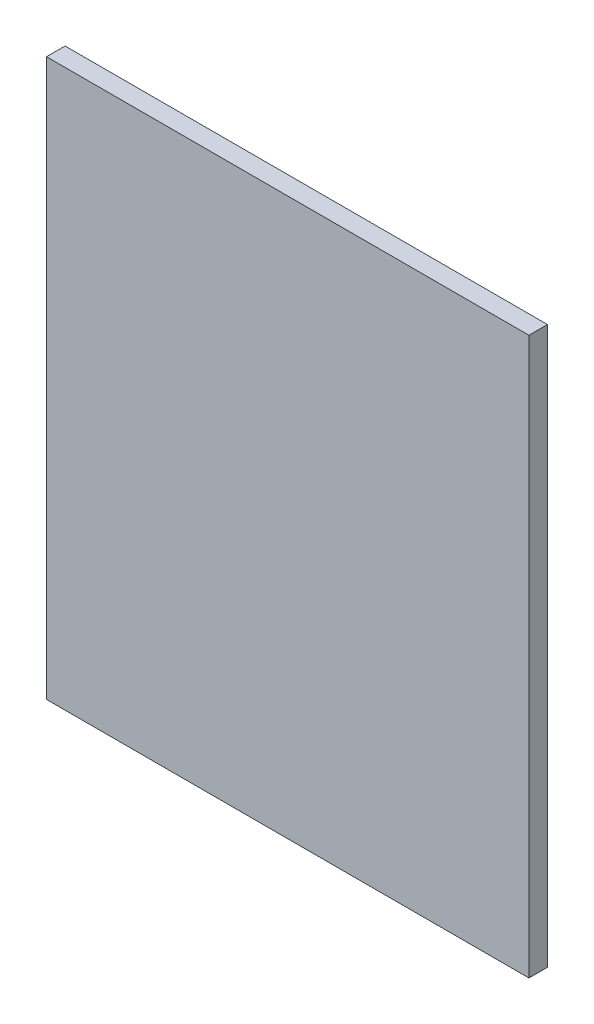
ISO-10303-21;
HEADER;
FILE_DESCRIPTION(('STEP AP214'),'2;1');
FILE_NAME('part.step','',(''),(''),'','','');
FILE_SCHEMA(('AUTOMOTIVE_DESIGN { 1 0 10303 214 1 1 1 1 }'));
ENDSEC;
DATA;
#1=APPLICATION_CONTEXT('core data for automotive mechanical design processes');
#2=APPLICATION_PROTOCOL_DEFINITION('international standard','automotive_design',2000,#1);
#3=PRODUCT_CONTEXT('',#1,'mechanical');
#4=PRODUCT('Part','Part','',(#3));
#5=PRODUCT_RELATED_PRODUCT_CATEGORY('part','',(#4));
#6=PRODUCT_DEFINITION_FORMATION('','',#4);
#7=PRODUCT_DEFINITION_CONTEXT('part definition',#1,'design');
#8=PRODUCT_DEFINITION('design','',#6,#7);
#9=PRODUCT_DEFINITION_SHAPE('','',#8);
#10=(LENGTH_UNIT() NAMED_UNIT(*) SI_UNIT(.MILLI.,.METRE.));
#11=(NAMED_UNIT(*) PLANE_ANGLE_UNIT() SI_UNIT($,.RADIAN.));
#12=(NAMED_UNIT(*) SI_UNIT($,.STERADIAN.) SOLID_ANGLE_UNIT());
#13=UNCERTAINTY_MEASURE_WITH_UNIT(LENGTH_MEASURE(1.E-05),#10,'distance_accuracy_value','');
#14=(GEOMETRIC_REPRESENTATION_CONTEXT(3) GLOBAL_UNCERTAINTY_ASSIGNED_CONTEXT((#13)) GLOBAL_UNIT_ASSIGNED_CONTEXT((#10,
#11,#12)) REPRESENTATION_CONTEXT('',''));
#15=CARTESIAN_POINT('',(0.,0.,0.));
#16=DIRECTION('',(0.,0.,1.));
#17=DIRECTION('',(1.,0.,0.));
#18=AXIS2_PLACEMENT_3D('',#15,#16,#17);
#19=CARTESIAN_POINT('',(0.,0.,2.));
#20=DIRECTION('',(1.,0.,0.));
#21=DIRECTION('',(0.,0.,-1.));
#22=AXIS2_PLACEMENT_3D('',#19,#20,#21);
#23=PLANE('',#22);
#24=DIRECTION('',(0.,-1.,0.));
#25=VECTOR('',#24,1.);
#26=CARTESIAN_POINT('',(0.,0.,0.));
#27=LINE('',#26,#25);
#28=CARTESIAN_POINT('',(0.,60.,0.));
#29=VERTEX_POINT('',#28);
#30=CARTESIAN_POINT('',(0.,0.,0.));
#31=VERTEX_POINT('',#30);
#32=EDGE_CURVE('E110',#29,#31,#27,.T.);
#33=ORIENTED_EDGE('',*,*,#32,.T.);
#34=DIRECTION('',(0.,0.,-1.));
#35=VECTOR('',#34,1.);
#36=CARTESIAN_POINT('',(0.,0.,2.));
#37=LINE('',#36,#35);
#38=CARTESIAN_POINT('',(0.,0.,2.));
#39=VERTEX_POINT('',#38);
#40=EDGE_CURVE('E11',#39,#31,#37,.T.);
#41=ORIENTED_EDGE('',*,*,#40,.F.);
#42=DIRECTION('',(0.,-1.,0.));
#43=VECTOR('',#42,1.);
#44=CARTESIAN_POINT('',(0.,0.,2.));
#45=LINE('',#44,#43);
#46=CARTESIAN_POINT('',(0.,60.,2.));
#47=VERTEX_POINT('',#46);
#48=EDGE_CURVE('E94',#47,#39,#45,.T.);
#49=ORIENTED_EDGE('',*,*,#48,.F.);
#50=DIRECTION('',(0.,0.,-1.));
#51=VECTOR('',#50,1.);
#52=CARTESIAN_POINT('',(0.,60.,2.));
#53=LINE('',#52,#51);
#54=EDGE_CURVE('E106',#47,#29,#53,.T.);
#55=ORIENTED_EDGE('',*,*,#54,.T.);
#56=EDGE_LOOP('',(#33,#41,#49,#55));
#57=FACE_BOUND('',#56,.T.);
#58=ADVANCED_FACE('F42',(#57),#23,.F.);
#59=CARTESIAN_POINT('',(0.,0.,2.));
#60=DIRECTION('',(0.,1.,0.));
#61=DIRECTION('',(0.,0.,1.));
#62=AXIS2_PLACEMENT_3D('',#59,#60,#61);
#63=PLANE('',#62);
#64=DIRECTION('',(1.,0.,0.));
#65=VECTOR('',#64,1.);
#66=CARTESIAN_POINT('',(0.,0.,0.));
#67=LINE('',#66,#65);
#68=CARTESIAN_POINT('',(52.,0.,0.));
#69=VERTEX_POINT('',#68);
#70=EDGE_CURVE('E99',#31,#69,#67,.T.);
#71=ORIENTED_EDGE('',*,*,#70,.T.);
#72=DIRECTION('',(0.,0.,-1.));
#73=VECTOR('',#72,1.);
#74=CARTESIAN_POINT('',(52.,0.,2.));
#75=LINE('',#74,#73);
#76=CARTESIAN_POINT('',(52.,0.,2.));
#77=VERTEX_POINT('',#76);
#78=EDGE_CURVE('E51',#77,#69,#75,.T.);
#79=ORIENTED_EDGE('',*,*,#78,.F.);
#80=DIRECTION('',(1.,0.,0.));
#81=VECTOR('',#80,1.);
#82=CARTESIAN_POINT('',(0.,0.,2.));
#83=LINE('',#82,#81);
#84=EDGE_CURVE('E89',#39,#77,#83,.T.);
#85=ORIENTED_EDGE('',*,*,#84,.F.);
#86=ORIENTED_EDGE('',*,*,#40,.T.);
#87=EDGE_LOOP('',(#71,#79,#85,#86));
#88=FACE_BOUND('',#87,.T.);
#89=ADVANCED_FACE('F98',(#88),#63,.F.);
#90=CARTESIAN_POINT('',(52.,0.,2.));
#91=DIRECTION('',(-1.,0.,0.));
#92=DIRECTION('',(0.,0.,1.));
#93=AXIS2_PLACEMENT_3D('',#90,#91,#92);
#94=PLANE('',#93);
#95=DIRECTION('',(0.,1.,0.));
#96=VECTOR('',#95,1.);
#97=CARTESIAN_POINT('',(52.,0.,0.));
#98=LINE('',#97,#96);
#99=CARTESIAN_POINT('',(52.,60.,0.));
#100=VERTEX_POINT('',#99);
#101=EDGE_CURVE('E76',#69,#100,#98,.T.);
#102=ORIENTED_EDGE('',*,*,#101,.T.);
#103=DIRECTION('',(0.,0.,-1.));
#104=VECTOR('',#103,1.);
#105=CARTESIAN_POINT('',(52.,60.,2.));
#106=LINE('',#105,#104);
#107=CARTESIAN_POINT('',(52.,60.,2.));
#108=VERTEX_POINT('',#107);
#109=EDGE_CURVE('E101',#108,#100,#106,.T.);
#110=ORIENTED_EDGE('',*,*,#109,.F.);
#111=DIRECTION('',(0.,1.,0.));
#112=VECTOR('',#111,1.);
#113=CARTESIAN_POINT('',(52.,0.,2.));
#114=LINE('',#113,#112);
#115=EDGE_CURVE('E92',#77,#108,#114,.T.);
#116=ORIENTED_EDGE('',*,*,#115,.F.);
#117=ORIENTED_EDGE('',*,*,#78,.T.);
#118=EDGE_LOOP('',(#102,#110,#116,#117));
#119=FACE_BOUND('',#118,.T.);
#120=ADVANCED_FACE('F102',(#119),#94,.F.);
#121=CARTESIAN_POINT('',(0.,60.,2.));
#122=DIRECTION('',(0.,-1.,0.));
#123=DIRECTION('',(0.,0.,-1.));
#124=AXIS2_PLACEMENT_3D('',#121,#122,#123);
#125=PLANE('',#124);
#126=DIRECTION('',(-1.,0.,0.));
#127=VECTOR('',#126,1.);
#128=CARTESIAN_POINT('',(0.,60.,0.));
#129=LINE('',#128,#127);
#130=EDGE_CURVE('E82',#100,#29,#129,.T.);
#131=ORIENTED_EDGE('',*,*,#130,.T.);
#132=ORIENTED_EDGE('',*,*,#54,.F.);
#133=DIRECTION('',(-1.,0.,0.));
#134=VECTOR('',#133,1.);
#135=CARTESIAN_POINT('',(0.,60.,2.));
#136=LINE('',#135,#134);
#137=EDGE_CURVE('E59',#108,#47,#136,.T.);
#138=ORIENTED_EDGE('',*,*,#137,.F.);
#139=ORIENTED_EDGE('',*,*,#109,.T.);
#140=EDGE_LOOP('',(#131,#132,#138,#139));
#141=FACE_BOUND('',#140,.T.);
#142=ADVANCED_FACE('F123',(#141),#125,.F.);
#143=CARTESIAN_POINT('',(0.,0.,2.));
#144=DIRECTION('',(0.,0.,-1.));
#145=DIRECTION('',(-1.,0.,0.));
#146=AXIS2_PLACEMENT_3D('',#143,#144,#145);
#147=PLANE('',#146);
#148=ORIENTED_EDGE('',*,*,#48,.T.);
#149=ORIENTED_EDGE('',*,*,#84,.T.);
#150=ORIENTED_EDGE('',*,*,#115,.T.);
#151=ORIENTED_EDGE('',*,*,#137,.T.);
#152=EDGE_LOOP('',(#148,#149,#150,#151));
#153=FACE_BOUND('',#152,.T.);
#154=ADVANCED_FACE('F90',(#153),#147,.F.);
#155=CARTESIAN_POINT('',(0.,0.,0.));
#156=DIRECTION('',(0.,0.,-1.));
#157=DIRECTION('',(-1.,0.,0.));
#158=AXIS2_PLACEMENT_3D('',#155,#156,#157);
#159=PLANE('',#158);
#160=ORIENTED_EDGE('',*,*,#32,.F.);
#161=ORIENTED_EDGE('',*,*,#130,.F.);
#162=ORIENTED_EDGE('',*,*,#101,.F.);
#163=ORIENTED_EDGE('',*,*,#70,.F.);
#164=EDGE_LOOP('',(#160,#161,#162,#163));
#165=FACE_BOUND('',#164,.T.);
#166=ADVANCED_FACE('F126',(#165),#159,.T.);
#167=CLOSED_SHELL('',(#58,#89,#120,#142,#154,#166));
#168=MANIFOLD_SOLID_BREP('B2',#167);
#169=ADVANCED_BREP_SHAPE_REPRESENTATION('',(#18,#168),#14);
#170=SHAPE_DEFINITION_REPRESENTATION(#9,#169);
ENDSEC;
END-ISO-10303-21;
